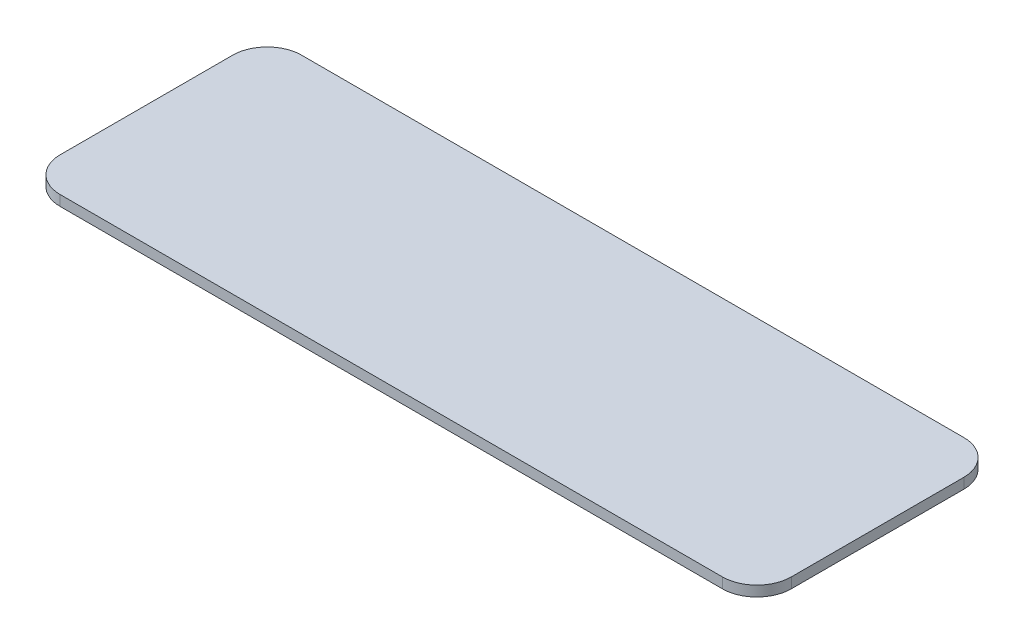
ISO-10303-21;
HEADER;
FILE_DESCRIPTION(('STEP AP214'),'2;1');
FILE_NAME('part.step','',(''),(''),'','','');
FILE_SCHEMA(('AUTOMOTIVE_DESIGN { 1 0 10303 214 1 1 1 1 }'));
ENDSEC;
DATA;
#1=APPLICATION_CONTEXT('core data for automotive mechanical design processes');
#2=APPLICATION_PROTOCOL_DEFINITION('international standard','automotive_design',2000,#1);
#3=PRODUCT_CONTEXT('',#1,'mechanical');
#4=PRODUCT('Part','Part','',(#3));
#5=PRODUCT_RELATED_PRODUCT_CATEGORY('part','',(#4));
#6=PRODUCT_DEFINITION_FORMATION('','',#4);
#7=PRODUCT_DEFINITION_CONTEXT('part definition',#1,'design');
#8=PRODUCT_DEFINITION('design','',#6,#7);
#9=PRODUCT_DEFINITION_SHAPE('','',#8);
#10=(LENGTH_UNIT() NAMED_UNIT(*) SI_UNIT(.MILLI.,.METRE.));
#11=(NAMED_UNIT(*) PLANE_ANGLE_UNIT() SI_UNIT($,.RADIAN.));
#12=(NAMED_UNIT(*) SI_UNIT($,.STERADIAN.) SOLID_ANGLE_UNIT());
#13=UNCERTAINTY_MEASURE_WITH_UNIT(LENGTH_MEASURE(1.E-05),#10,'distance_accuracy_value','');
#14=(GEOMETRIC_REPRESENTATION_CONTEXT(3) GLOBAL_UNCERTAINTY_ASSIGNED_CONTEXT((#13)) GLOBAL_UNIT_ASSIGNED_CONTEXT((#10,
#11,#12)) REPRESENTATION_CONTEXT('',''));
#15=CARTESIAN_POINT('',(0.,0.,0.));
#16=DIRECTION('',(0.,0.,1.));
#17=DIRECTION('',(1.,0.,0.));
#18=AXIS2_PLACEMENT_3D('',#15,#16,#17);
#19=CARTESIAN_POINT('',(106.,3.,35.));
#20=DIRECTION('',(-1.,0.,0.));
#21=DIRECTION('',(0.,0.,1.));
#22=AXIS2_PLACEMENT_3D('',#19,#20,#21);
#23=PLANE('',#22);
#24=DIRECTION('',(0.,0.,-1.));
#25=VECTOR('',#24,1.);
#26=CARTESIAN_POINT('',(106.,3.,35.));
#27=LINE('',#26,#25);
#28=CARTESIAN_POINT('',(106.,3.,25.));
#29=VERTEX_POINT('',#28);
#30=CARTESIAN_POINT('',(106.,3.,-25.));
#31=VERTEX_POINT('',#30);
#32=EDGE_CURVE('E127',#29,#31,#27,.T.);
#33=ORIENTED_EDGE('',*,*,#32,.F.);
#34=DIRECTION('',(0.,-1.,0.));
#35=VECTOR('',#34,1.);
#36=CARTESIAN_POINT('',(106.,3.,25.));
#37=LINE('',#36,#35);
#38=CARTESIAN_POINT('',(106.,0.,25.));
#39=VERTEX_POINT('',#38);
#40=EDGE_CURVE('E153',#29,#39,#37,.T.);
#41=ORIENTED_EDGE('',*,*,#40,.T.);
#42=DIRECTION('',(0.,0.,-1.));
#43=VECTOR('',#42,1.);
#44=CARTESIAN_POINT('',(106.,0.,35.));
#45=LINE('',#44,#43);
#46=CARTESIAN_POINT('',(106.,0.,-25.));
#47=VERTEX_POINT('',#46);
#48=EDGE_CURVE('E159',#39,#47,#45,.T.);
#49=ORIENTED_EDGE('',*,*,#48,.T.);
#50=DIRECTION('',(0.,-1.,0.));
#51=VECTOR('',#50,1.);
#52=CARTESIAN_POINT('',(106.,3.,-25.));
#53=LINE('',#52,#51);
#54=EDGE_CURVE('E151',#47,#31,#53,.F.);
#55=ORIENTED_EDGE('',*,*,#54,.T.);
#56=EDGE_LOOP('',(#33,#41,#49,#55));
#57=FACE_BOUND('',#56,.T.);
#58=ADVANCED_FACE('F35',(#57),#23,.F.);
#59=CARTESIAN_POINT('',(-106.,3.,-35.));
#60=DIRECTION('',(0.,0.,1.));
#61=DIRECTION('',(1.,0.,0.));
#62=AXIS2_PLACEMENT_3D('',#59,#60,#61);
#63=PLANE('',#62);
#64=DIRECTION('',(-1.,0.,0.));
#65=VECTOR('',#64,1.);
#66=CARTESIAN_POINT('',(-106.,3.,-35.));
#67=LINE('',#66,#65);
#68=CARTESIAN_POINT('',(96.,3.,-35.));
#69=VERTEX_POINT('',#68);
#70=CARTESIAN_POINT('',(-96.,3.,-35.));
#71=VERTEX_POINT('',#70);
#72=EDGE_CURVE('E130',#69,#71,#67,.T.);
#73=ORIENTED_EDGE('',*,*,#72,.F.);
#74=DIRECTION('',(0.,-1.,0.));
#75=VECTOR('',#74,1.);
#76=CARTESIAN_POINT('',(96.,3.,-35.));
#77=LINE('',#76,#75);
#78=CARTESIAN_POINT('',(96.,0.,-35.));
#79=VERTEX_POINT('',#78);
#80=EDGE_CURVE('E11',#69,#79,#77,.T.);
#81=ORIENTED_EDGE('',*,*,#80,.T.);
#82=DIRECTION('',(-1.,0.,0.));
#83=VECTOR('',#82,1.);
#84=CARTESIAN_POINT('',(-106.,0.,-35.));
#85=LINE('',#84,#83);
#86=CARTESIAN_POINT('',(-96.,0.,-35.));
#87=VERTEX_POINT('',#86);
#88=EDGE_CURVE('E132',#79,#87,#85,.T.);
#89=ORIENTED_EDGE('',*,*,#88,.T.);
#90=DIRECTION('',(0.,-1.,0.));
#91=VECTOR('',#90,1.);
#92=CARTESIAN_POINT('',(-96.,3.,-35.));
#93=LINE('',#92,#91);
#94=EDGE_CURVE('E43',#87,#71,#93,.F.);
#95=ORIENTED_EDGE('',*,*,#94,.T.);
#96=EDGE_LOOP('',(#73,#81,#89,#95));
#97=FACE_BOUND('',#96,.T.);
#98=ADVANCED_FACE('F178',(#97),#63,.F.);
#99=CARTESIAN_POINT('',(-106.,3.,35.));
#100=DIRECTION('',(1.,0.,0.));
#101=DIRECTION('',(0.,0.,-1.));
#102=AXIS2_PLACEMENT_3D('',#99,#100,#101);
#103=PLANE('',#102);
#104=DIRECTION('',(0.,0.,1.));
#105=VECTOR('',#104,1.);
#106=CARTESIAN_POINT('',(-106.,0.,35.));
#107=LINE('',#106,#105);
#108=CARTESIAN_POINT('',(-106.,0.,-25.));
#109=VERTEX_POINT('',#108);
#110=CARTESIAN_POINT('',(-106.,0.,25.));
#111=VERTEX_POINT('',#110);
#112=EDGE_CURVE('E128',#109,#111,#107,.T.);
#113=ORIENTED_EDGE('',*,*,#112,.T.);
#114=DIRECTION('',(0.,-1.,0.));
#115=VECTOR('',#114,1.);
#116=CARTESIAN_POINT('',(-106.,3.,25.));
#117=LINE('',#116,#115);
#118=CARTESIAN_POINT('',(-106.,3.,25.));
#119=VERTEX_POINT('',#118);
#120=EDGE_CURVE('E106',#111,#119,#117,.F.);
#121=ORIENTED_EDGE('',*,*,#120,.T.);
#122=DIRECTION('',(0.,0.,1.));
#123=VECTOR('',#122,1.);
#124=CARTESIAN_POINT('',(-106.,3.,35.));
#125=LINE('',#124,#123);
#126=CARTESIAN_POINT('',(-106.,3.,-25.));
#127=VERTEX_POINT('',#126);
#128=EDGE_CURVE('E167',#127,#119,#125,.T.);
#129=ORIENTED_EDGE('',*,*,#128,.F.);
#130=DIRECTION('',(0.,-1.,0.));
#131=VECTOR('',#130,1.);
#132=CARTESIAN_POINT('',(-106.,3.,-25.));
#133=LINE('',#132,#131);
#134=EDGE_CURVE('E111',#127,#109,#133,.T.);
#135=ORIENTED_EDGE('',*,*,#134,.T.);
#136=EDGE_LOOP('',(#113,#121,#129,#135));
#137=FACE_BOUND('',#136,.T.);
#138=ADVANCED_FACE('F177',(#137),#103,.F.);
#139=CARTESIAN_POINT('',(-106.,3.,35.));
#140=DIRECTION('',(0.,0.,-1.));
#141=DIRECTION('',(-1.,0.,0.));
#142=AXIS2_PLACEMENT_3D('',#139,#140,#141);
#143=PLANE('',#142);
#144=DIRECTION('',(1.,0.,0.));
#145=VECTOR('',#144,1.);
#146=CARTESIAN_POINT('',(-106.,3.,35.));
#147=LINE('',#146,#145);
#148=CARTESIAN_POINT('',(-96.,3.,35.));
#149=VERTEX_POINT('',#148);
#150=CARTESIAN_POINT('',(96.,3.,35.));
#151=VERTEX_POINT('',#150);
#152=EDGE_CURVE('E121',#149,#151,#147,.T.);
#153=ORIENTED_EDGE('',*,*,#152,.F.);
#154=DIRECTION('',(0.,-1.,0.));
#155=VECTOR('',#154,1.);
#156=CARTESIAN_POINT('',(-96.,3.,35.));
#157=LINE('',#156,#155);
#158=CARTESIAN_POINT('',(-96.,0.,35.));
#159=VERTEX_POINT('',#158);
#160=EDGE_CURVE('E105',#149,#159,#157,.T.);
#161=ORIENTED_EDGE('',*,*,#160,.T.);
#162=DIRECTION('',(1.,0.,0.));
#163=VECTOR('',#162,1.);
#164=CARTESIAN_POINT('',(-106.,0.,35.));
#165=LINE('',#164,#163);
#166=CARTESIAN_POINT('',(96.,0.,35.));
#167=VERTEX_POINT('',#166);
#168=EDGE_CURVE('E118',#159,#167,#165,.T.);
#169=ORIENTED_EDGE('',*,*,#168,.T.);
#170=DIRECTION('',(0.,-1.,0.));
#171=VECTOR('',#170,1.);
#172=CARTESIAN_POINT('',(96.,3.,35.));
#173=LINE('',#172,#171);
#174=EDGE_CURVE('E123',#167,#151,#173,.F.);
#175=ORIENTED_EDGE('',*,*,#174,.T.);
#176=EDGE_LOOP('',(#153,#161,#169,#175));
#177=FACE_BOUND('',#176,.T.);
#178=ADVANCED_FACE('F117',(#177),#143,.F.);
#179=CARTESIAN_POINT('',(0.,3.,0.));
#180=DIRECTION('',(0.,-1.,0.));
#181=DIRECTION('',(0.,0.,-1.));
#182=AXIS2_PLACEMENT_3D('',#179,#180,#181);
#183=PLANE('',#182);
#184=ORIENTED_EDGE('',*,*,#128,.T.);
#185=CARTESIAN_POINT('',(-96.,3.,25.));
#186=DIRECTION('',(0.,-1.,0.));
#187=DIRECTION('',(0.,0.,-1.));
#188=AXIS2_PLACEMENT_3D('',#185,#186,#187);
#189=CIRCLE('',#188,10.);
#190=EDGE_CURVE('E149',#119,#149,#189,.F.);
#191=ORIENTED_EDGE('',*,*,#190,.T.);
#192=ORIENTED_EDGE('',*,*,#152,.T.);
#193=CARTESIAN_POINT('',(96.,3.,25.));
#194=DIRECTION('',(0.,-1.,0.));
#195=DIRECTION('',(0.,0.,-1.));
#196=AXIS2_PLACEMENT_3D('',#193,#194,#195);
#197=CIRCLE('',#196,10.);
#198=EDGE_CURVE('E147',#151,#29,#197,.F.);
#199=ORIENTED_EDGE('',*,*,#198,.T.);
#200=ORIENTED_EDGE('',*,*,#32,.T.);
#201=CARTESIAN_POINT('',(96.,3.,-25.));
#202=DIRECTION('',(0.,-1.,0.));
#203=DIRECTION('',(0.,0.,-1.));
#204=AXIS2_PLACEMENT_3D('',#201,#202,#203);
#205=CIRCLE('',#204,10.);
#206=EDGE_CURVE('E56',#31,#69,#205,.F.);
#207=ORIENTED_EDGE('',*,*,#206,.T.);
#208=ORIENTED_EDGE('',*,*,#72,.T.);
#209=CARTESIAN_POINT('',(-96.,3.,-25.));
#210=DIRECTION('',(0.,-1.,0.));
#211=DIRECTION('',(0.,0.,-1.));
#212=AXIS2_PLACEMENT_3D('',#209,#210,#211);
#213=CIRCLE('',#212,10.);
#214=EDGE_CURVE('E144',#71,#127,#213,.F.);
#215=ORIENTED_EDGE('',*,*,#214,.T.);
#216=EDGE_LOOP('',(#184,#191,#192,#199,#200,#207,#208,#215));
#217=FACE_BOUND('',#216,.T.);
#218=ADVANCED_FACE('F171',(#217),#183,.F.);
#219=CARTESIAN_POINT('',(0.,0.,0.));
#220=DIRECTION('',(0.,-1.,0.));
#221=DIRECTION('',(0.,0.,-1.));
#222=AXIS2_PLACEMENT_3D('',#219,#220,#221);
#223=PLANE('',#222);
#224=ORIENTED_EDGE('',*,*,#168,.F.);
#225=CARTESIAN_POINT('',(-96.,0.,25.));
#226=DIRECTION('',(0.,-1.,0.));
#227=DIRECTION('',(0.,0.,-1.));
#228=AXIS2_PLACEMENT_3D('',#225,#226,#227);
#229=CIRCLE('',#228,10.);
#230=EDGE_CURVE('E101',#159,#111,#229,.T.);
#231=ORIENTED_EDGE('',*,*,#230,.T.);
#232=ORIENTED_EDGE('',*,*,#112,.F.);
#233=CARTESIAN_POINT('',(-96.,0.,-25.));
#234=DIRECTION('',(0.,-1.,0.));
#235=DIRECTION('',(0.,0.,-1.));
#236=AXIS2_PLACEMENT_3D('',#233,#234,#235);
#237=CIRCLE('',#236,10.);
#238=EDGE_CURVE('E122',#109,#87,#237,.T.);
#239=ORIENTED_EDGE('',*,*,#238,.T.);
#240=ORIENTED_EDGE('',*,*,#88,.F.);
#241=CARTESIAN_POINT('',(96.,0.,-25.));
#242=DIRECTION('',(0.,-1.,0.));
#243=DIRECTION('',(0.,0.,-1.));
#244=AXIS2_PLACEMENT_3D('',#241,#242,#243);
#245=CIRCLE('',#244,10.);
#246=EDGE_CURVE('E138',#79,#47,#245,.T.);
#247=ORIENTED_EDGE('',*,*,#246,.T.);
#248=ORIENTED_EDGE('',*,*,#48,.F.);
#249=CARTESIAN_POINT('',(96.,0.,25.));
#250=DIRECTION('',(0.,-1.,0.));
#251=DIRECTION('',(0.,0.,-1.));
#252=AXIS2_PLACEMENT_3D('',#249,#250,#251);
#253=CIRCLE('',#252,10.);
#254=EDGE_CURVE('E112',#39,#167,#253,.T.);
#255=ORIENTED_EDGE('',*,*,#254,.T.);
#256=EDGE_LOOP('',(#224,#231,#232,#239,#240,#247,#248,#255));
#257=FACE_BOUND('',#256,.T.);
#258=ADVANCED_FACE('F125',(#257),#223,.T.);
#259=CARTESIAN_POINT('',(-96.,3.,25.));
#260=DIRECTION('',(0.,-1.,0.));
#261=DIRECTION('',(0.,0.,-1.));
#262=AXIS2_PLACEMENT_3D('',#259,#260,#261);
#263=CYLINDRICAL_SURFACE('',#262,10.);
#264=ORIENTED_EDGE('',*,*,#190,.F.);
#265=ORIENTED_EDGE('',*,*,#120,.F.);
#266=ORIENTED_EDGE('',*,*,#230,.F.);
#267=ORIENTED_EDGE('',*,*,#160,.F.);
#268=EDGE_LOOP('',(#264,#265,#266,#267));
#269=FACE_BOUND('',#268,.T.);
#270=ADVANCED_FACE('F104',(#269),#263,.T.);
#271=CARTESIAN_POINT('',(96.,3.,25.));
#272=DIRECTION('',(0.,-1.,0.));
#273=DIRECTION('',(0.,0.,-1.));
#274=AXIS2_PLACEMENT_3D('',#271,#272,#273);
#275=CYLINDRICAL_SURFACE('',#274,10.);
#276=ORIENTED_EDGE('',*,*,#198,.F.);
#277=ORIENTED_EDGE('',*,*,#174,.F.);
#278=ORIENTED_EDGE('',*,*,#254,.F.);
#279=ORIENTED_EDGE('',*,*,#40,.F.);
#280=EDGE_LOOP('',(#276,#277,#278,#279));
#281=FACE_BOUND('',#280,.T.);
#282=ADVANCED_FACE('F181',(#281),#275,.T.);
#283=CARTESIAN_POINT('',(96.,3.,-25.));
#284=DIRECTION('',(0.,-1.,0.));
#285=DIRECTION('',(0.,0.,-1.));
#286=AXIS2_PLACEMENT_3D('',#283,#284,#285);
#287=CYLINDRICAL_SURFACE('',#286,10.);
#288=ORIENTED_EDGE('',*,*,#206,.F.);
#289=ORIENTED_EDGE('',*,*,#54,.F.);
#290=ORIENTED_EDGE('',*,*,#246,.F.);
#291=ORIENTED_EDGE('',*,*,#80,.F.);
#292=EDGE_LOOP('',(#288,#289,#290,#291));
#293=FACE_BOUND('',#292,.T.);
#294=ADVANCED_FACE('F180',(#293),#287,.T.);
#295=CARTESIAN_POINT('',(-96.,3.,-25.));
#296=DIRECTION('',(0.,-1.,0.));
#297=DIRECTION('',(0.,0.,-1.));
#298=AXIS2_PLACEMENT_3D('',#295,#296,#297);
#299=CYLINDRICAL_SURFACE('',#298,10.);
#300=ORIENTED_EDGE('',*,*,#214,.F.);
#301=ORIENTED_EDGE('',*,*,#94,.F.);
#302=ORIENTED_EDGE('',*,*,#238,.F.);
#303=ORIENTED_EDGE('',*,*,#134,.F.);
#304=EDGE_LOOP('',(#300,#301,#302,#303));
#305=FACE_BOUND('',#304,.T.);
#306=ADVANCED_FACE('F37',(#305),#299,.T.);
#307=CLOSED_SHELL('',(#58,#98,#138,#178,#218,#258,#270,#282,#294,#306));
#308=MANIFOLD_SOLID_BREP('B2',#307);
#309=ADVANCED_BREP_SHAPE_REPRESENTATION('',(#18,#308),#14);
#310=SHAPE_DEFINITION_REPRESENTATION(#9,#309);
ENDSEC;
END-ISO-10303-21;
